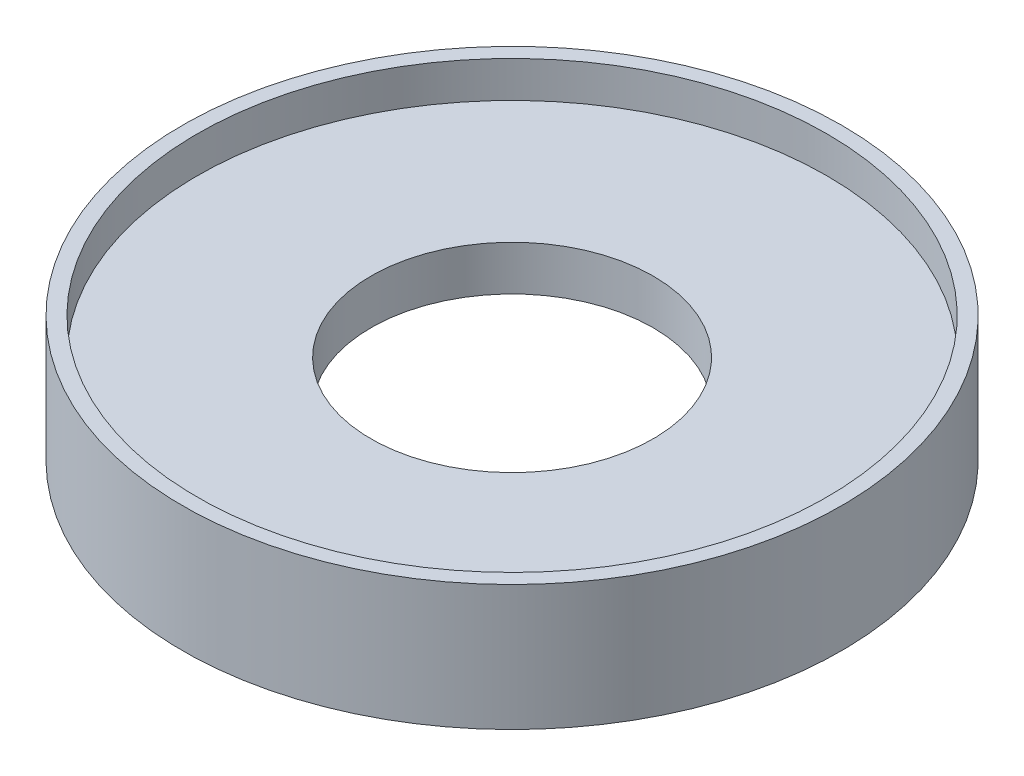
ISO-10303-21;
HEADER;
FILE_DESCRIPTION(('STEP AP214'),'2;1');
FILE_NAME('part.step','',(''),(''),'','','');
FILE_SCHEMA(('AUTOMOTIVE_DESIGN { 1 0 10303 214 1 1 1 1 }'));
ENDSEC;
DATA;
#1=APPLICATION_CONTEXT('core data for automotive mechanical design processes');
#2=APPLICATION_PROTOCOL_DEFINITION('international standard','automotive_design',2000,#1);
#3=PRODUCT_CONTEXT('',#1,'mechanical');
#4=PRODUCT('Part','Part','',(#3));
#5=PRODUCT_RELATED_PRODUCT_CATEGORY('part','',(#4));
#6=PRODUCT_DEFINITION_FORMATION('','',#4);
#7=PRODUCT_DEFINITION_CONTEXT('part definition',#1,'design');
#8=PRODUCT_DEFINITION('design','',#6,#7);
#9=PRODUCT_DEFINITION_SHAPE('','',#8);
#10=(LENGTH_UNIT() NAMED_UNIT(*) SI_UNIT(.MILLI.,.METRE.));
#11=(NAMED_UNIT(*) PLANE_ANGLE_UNIT() SI_UNIT($,.RADIAN.));
#12=(NAMED_UNIT(*) SI_UNIT($,.STERADIAN.) SOLID_ANGLE_UNIT());
#13=UNCERTAINTY_MEASURE_WITH_UNIT(LENGTH_MEASURE(1.E-05),#10,'distance_accuracy_value','');
#14=(GEOMETRIC_REPRESENTATION_CONTEXT(3) GLOBAL_UNCERTAINTY_ASSIGNED_CONTEXT((#13)) GLOBAL_UNIT_ASSIGNED_CONTEXT((#10,
#11,#12)) REPRESENTATION_CONTEXT('',''));
#15=CARTESIAN_POINT('',(0.,0.,0.));
#16=DIRECTION('',(0.,0.,1.));
#17=DIRECTION('',(1.,0.,0.));
#18=AXIS2_PLACEMENT_3D('',#15,#16,#17);
#19=CARTESIAN_POINT('',(0.,0.,0.));
#20=DIRECTION('',(0.,-1.,0.));
#21=DIRECTION('',(0.,0.,-1.));
#22=AXIS2_PLACEMENT_3D('',#19,#20,#21);
#23=CYLINDRICAL_SURFACE('',#22,19.05);
#24=CARTESIAN_POINT('',(0.,0.,0.));
#25=DIRECTION('',(0.,-1.,0.));
#26=DIRECTION('',(0.,0.,-1.));
#27=AXIS2_PLACEMENT_3D('',#24,#25,#26);
#28=CIRCLE('',#27,19.05);
#29=CARTESIAN_POINT('',(0.,0.,-19.05));
#30=VERTEX_POINT('',#29);
#31=EDGE_CURVE('E10',#30,#30,#28,.T.);
#32=ORIENTED_EDGE('',*,*,#31,.T.);
#33=EDGE_LOOP('',(#32));
#34=FACE_BOUND('',#33,.T.);
#35=CARTESIAN_POINT('',(0.,6.05,0.));
#36=DIRECTION('',(0.,-1.,0.));
#37=DIRECTION('',(0.,0.,-1.));
#38=AXIS2_PLACEMENT_3D('',#35,#36,#37);
#39=CIRCLE('',#38,19.05);
#40=CARTESIAN_POINT('',(0.,6.05,-19.05));
#41=VERTEX_POINT('',#40);
#42=EDGE_CURVE('E61',#41,#41,#39,.T.);
#43=ORIENTED_EDGE('',*,*,#42,.F.);
#44=EDGE_LOOP('',(#43));
#45=FACE_BOUND('',#44,.T.);
#46=ADVANCED_FACE('F33',(#34,#45),#23,.F.);
#47=CARTESIAN_POINT('',(0.,0.,-19.05));
#48=DIRECTION('',(0.,-1.,0.));
#49=DIRECTION('',(0.,0.,-1.));
#50=AXIS2_PLACEMENT_3D('',#47,#48,#49);
#51=PLANE('',#50);
#52=CARTESIAN_POINT('',(0.,0.,0.));
#53=DIRECTION('',(0.,-1.,0.));
#54=DIRECTION('',(0.,0.,-1.));
#55=AXIS2_PLACEMENT_3D('',#52,#53,#54);
#56=CIRCLE('',#55,42.5);
#57=CARTESIAN_POINT('',(0.,0.,-42.5));
#58=VERTEX_POINT('',#57);
#59=EDGE_CURVE('E39',#58,#58,#56,.T.);
#60=ORIENTED_EDGE('',*,*,#59,.T.);
#61=EDGE_LOOP('',(#60));
#62=FACE_BOUND('',#61,.T.);
#63=ORIENTED_EDGE('',*,*,#31,.F.);
#64=EDGE_LOOP('',(#63));
#65=FACE_BOUND('',#64,.T.);
#66=ADVANCED_FACE('F69',(#62,#65),#51,.T.);
#67=CARTESIAN_POINT('',(0.,0.,0.));
#68=DIRECTION('',(0.,-1.,0.));
#69=DIRECTION('',(0.,0.,-1.));
#70=AXIS2_PLACEMENT_3D('',#67,#68,#69);
#71=CYLINDRICAL_SURFACE('',#70,42.5);
#72=CARTESIAN_POINT('',(0.,-6.,0.));
#73=DIRECTION('',(0.,-1.,0.));
#74=DIRECTION('',(0.,0.,-1.));
#75=AXIS2_PLACEMENT_3D('',#72,#73,#74);
#76=CIRCLE('',#75,42.5);
#77=CARTESIAN_POINT('',(0.,-6.,-42.5));
#78=VERTEX_POINT('',#77);
#79=EDGE_CURVE('E43',#78,#78,#76,.T.);
#80=ORIENTED_EDGE('',*,*,#79,.T.);
#81=EDGE_LOOP('',(#80));
#82=FACE_BOUND('',#81,.T.);
#83=ORIENTED_EDGE('',*,*,#59,.F.);
#84=EDGE_LOOP('',(#83));
#85=FACE_BOUND('',#84,.T.);
#86=ADVANCED_FACE('F73',(#82,#85),#71,.F.);
#87=CARTESIAN_POINT('',(0.,-6.,-42.5));
#88=DIRECTION('',(0.,-1.,0.));
#89=DIRECTION('',(0.,0.,-1.));
#90=AXIS2_PLACEMENT_3D('',#87,#88,#89);
#91=PLANE('',#90);
#92=CARTESIAN_POINT('',(0.,-6.,0.));
#93=DIRECTION('',(0.,-1.,0.));
#94=DIRECTION('',(0.,0.,-1.));
#95=AXIS2_PLACEMENT_3D('',#92,#93,#94);
#96=CIRCLE('',#95,44.5);
#97=CARTESIAN_POINT('',(0.,-6.,-44.5));
#98=VERTEX_POINT('',#97);
#99=EDGE_CURVE('E47',#98,#98,#96,.T.);
#100=ORIENTED_EDGE('',*,*,#99,.T.);
#101=EDGE_LOOP('',(#100));
#102=FACE_BOUND('',#101,.T.);
#103=ORIENTED_EDGE('',*,*,#79,.F.);
#104=EDGE_LOOP('',(#103));
#105=FACE_BOUND('',#104,.T.);
#106=ADVANCED_FACE('F77',(#102,#105),#91,.T.);
#107=CARTESIAN_POINT('',(0.,0.,0.));
#108=DIRECTION('',(0.,-1.,0.));
#109=DIRECTION('',(0.,0.,-1.));
#110=AXIS2_PLACEMENT_3D('',#107,#108,#109);
#111=CYLINDRICAL_SURFACE('',#110,44.5);
#112=CARTESIAN_POINT('',(0.,10.96,0.));
#113=DIRECTION('',(0.,-1.,0.));
#114=DIRECTION('',(0.,0.,-1.));
#115=AXIS2_PLACEMENT_3D('',#112,#113,#114);
#116=CIRCLE('',#115,44.5);
#117=CARTESIAN_POINT('',(0.,10.96,-44.5));
#118=VERTEX_POINT('',#117);
#119=EDGE_CURVE('E52',#118,#118,#116,.T.);
#120=ORIENTED_EDGE('',*,*,#119,.T.);
#121=EDGE_LOOP('',(#120));
#122=FACE_BOUND('',#121,.T.);
#123=ORIENTED_EDGE('',*,*,#99,.F.);
#124=EDGE_LOOP('',(#123));
#125=FACE_BOUND('',#124,.T.);
#126=ADVANCED_FACE('F84',(#122,#125),#111,.T.);
#127=CARTESIAN_POINT('',(0.,10.96,-44.5));
#128=DIRECTION('',(0.,1.,0.));
#129=DIRECTION('',(0.,0.,1.));
#130=AXIS2_PLACEMENT_3D('',#127,#128,#129);
#131=PLANE('',#130);
#132=CARTESIAN_POINT('',(0.,10.96,0.));
#133=DIRECTION('',(0.,-1.,0.));
#134=DIRECTION('',(0.,0.,-1.));
#135=AXIS2_PLACEMENT_3D('',#132,#133,#134);
#136=CIRCLE('',#135,42.5);
#137=CARTESIAN_POINT('',(0.,10.96,-42.5));
#138=VERTEX_POINT('',#137);
#139=EDGE_CURVE('E55',#138,#138,#136,.T.);
#140=ORIENTED_EDGE('',*,*,#139,.T.);
#141=EDGE_LOOP('',(#140));
#142=FACE_BOUND('',#141,.T.);
#143=ORIENTED_EDGE('',*,*,#119,.F.);
#144=EDGE_LOOP('',(#143));
#145=FACE_BOUND('',#144,.T.);
#146=ADVANCED_FACE('F88',(#142,#145),#131,.T.);
#147=CARTESIAN_POINT('',(0.,0.,0.));
#148=DIRECTION('',(0.,-1.,0.));
#149=DIRECTION('',(0.,0.,-1.));
#150=AXIS2_PLACEMENT_3D('',#147,#148,#149);
#151=CYLINDRICAL_SURFACE('',#150,42.5);
#152=CARTESIAN_POINT('',(0.,6.05,0.));
#153=DIRECTION('',(0.,-1.,0.));
#154=DIRECTION('',(0.,0.,-1.));
#155=AXIS2_PLACEMENT_3D('',#152,#153,#154);
#156=CIRCLE('',#155,42.5);
#157=CARTESIAN_POINT('',(0.,6.05,-42.5));
#158=VERTEX_POINT('',#157);
#159=EDGE_CURVE('E58',#158,#158,#156,.T.);
#160=ORIENTED_EDGE('',*,*,#159,.T.);
#161=EDGE_LOOP('',(#160));
#162=FACE_BOUND('',#161,.T.);
#163=ORIENTED_EDGE('',*,*,#139,.F.);
#164=EDGE_LOOP('',(#163));
#165=FACE_BOUND('',#164,.T.);
#166=ADVANCED_FACE('F92',(#162,#165),#151,.F.);
#167=CARTESIAN_POINT('',(0.,6.05,-42.5));
#168=DIRECTION('',(0.,1.,0.));
#169=DIRECTION('',(0.,0.,1.));
#170=AXIS2_PLACEMENT_3D('',#167,#168,#169);
#171=PLANE('',#170);
#172=ORIENTED_EDGE('',*,*,#42,.T.);
#173=EDGE_LOOP('',(#172));
#174=FACE_BOUND('',#173,.T.);
#175=ORIENTED_EDGE('',*,*,#159,.F.);
#176=EDGE_LOOP('',(#175));
#177=FACE_BOUND('',#176,.T.);
#178=ADVANCED_FACE('F65',(#174,#177),#171,.T.);
#179=CLOSED_SHELL('',(#46,#66,#86,#106,#126,#146,#166,#178));
#180=MANIFOLD_SOLID_BREP('B2',#179);
#181=ADVANCED_BREP_SHAPE_REPRESENTATION('',(#18,#180),#14);
#182=SHAPE_DEFINITION_REPRESENTATION(#9,#181);
ENDSEC;
END-ISO-10303-21;
